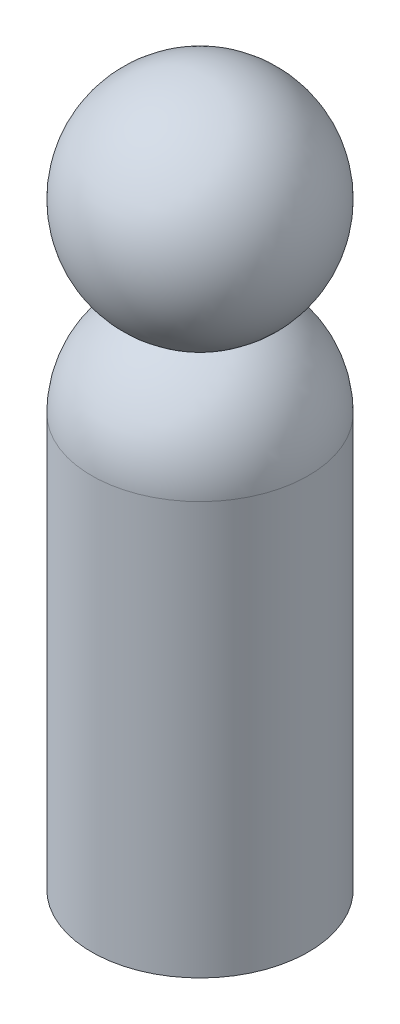
ISO-10303-21;
HEADER;
FILE_DESCRIPTION(('STEP AP214'),'2;1');
FILE_NAME('part.step','',(''),(''),'','','');
FILE_SCHEMA(('AUTOMOTIVE_DESIGN { 1 0 10303 214 1 1 1 1 }'));
ENDSEC;
DATA;
#1=APPLICATION_CONTEXT('core data for automotive mechanical design processes');
#2=APPLICATION_PROTOCOL_DEFINITION('international standard','automotive_design',2000,#1);
#3=PRODUCT_CONTEXT('',#1,'mechanical');
#4=PRODUCT('Part','Part','',(#3));
#5=PRODUCT_RELATED_PRODUCT_CATEGORY('part','',(#4));
#6=PRODUCT_DEFINITION_FORMATION('','',#4);
#7=PRODUCT_DEFINITION_CONTEXT('part definition',#1,'design');
#8=PRODUCT_DEFINITION('design','',#6,#7);
#9=PRODUCT_DEFINITION_SHAPE('','',#8);
#10=(LENGTH_UNIT() NAMED_UNIT(*) SI_UNIT(.MILLI.,.METRE.));
#11=(NAMED_UNIT(*) PLANE_ANGLE_UNIT() SI_UNIT($,.RADIAN.));
#12=(NAMED_UNIT(*) SI_UNIT($,.STERADIAN.) SOLID_ANGLE_UNIT());
#13=UNCERTAINTY_MEASURE_WITH_UNIT(LENGTH_MEASURE(1.E-05),#10,'distance_accuracy_value','');
#14=(GEOMETRIC_REPRESENTATION_CONTEXT(3) GLOBAL_UNCERTAINTY_ASSIGNED_CONTEXT((#13)) GLOBAL_UNIT_ASSIGNED_CONTEXT((#10,
#11,#12)) REPRESENTATION_CONTEXT('',''));
#15=CARTESIAN_POINT('',(0.,0.,0.));
#16=DIRECTION('',(0.,0.,1.));
#17=DIRECTION('',(1.,0.,0.));
#18=AXIS2_PLACEMENT_3D('',#15,#16,#17);
#19=CARTESIAN_POINT('',(0.,0.,0.));
#20=DIRECTION('',(0.,-1.,0.));
#21=DIRECTION('',(0.,0.,-1.));
#22=AXIS2_PLACEMENT_3D('',#19,#20,#21);
#23=CYLINDRICAL_SURFACE('',#22,21.43125);
#24=CARTESIAN_POINT('',(0.,81.6026206743408,0.));
#25=DIRECTION('',(0.,-1.,0.));
#26=DIRECTION('',(0.,0.,-1.));
#27=AXIS2_PLACEMENT_3D('',#24,#25,#26);
#28=CIRCLE('',#27,21.43125);
#29=CARTESIAN_POINT('',(0.,81.6026206743408,-21.43125));
#30=VERTEX_POINT('',#29);
#31=EDGE_CURVE('E11',#30,#30,#28,.T.);
#32=ORIENTED_EDGE('',*,*,#31,.T.);
#33=EDGE_LOOP('',(#32));
#34=FACE_BOUND('',#33,.T.);
#35=CARTESIAN_POINT('',(0.,0.,0.));
#36=DIRECTION('',(0.,-1.,0.));
#37=DIRECTION('',(0.,0.,-1.));
#38=AXIS2_PLACEMENT_3D('',#35,#36,#37);
#39=CIRCLE('',#38,21.43125);
#40=CARTESIAN_POINT('',(0.,0.,-21.43125));
#41=VERTEX_POINT('',#40);
#42=EDGE_CURVE('E46',#41,#41,#39,.T.);
#43=ORIENTED_EDGE('',*,*,#42,.F.);
#44=EDGE_LOOP('',(#43));
#45=FACE_BOUND('',#44,.T.);
#46=ADVANCED_FACE('F36',(#34,#45),#23,.T.);
#47=CARTESIAN_POINT('',(0.,81.602620674341,0.));
#48=DIRECTION('',(0.,-1.,0.));
#49=DIRECTION('',(0.,0.,-1.));
#50=AXIS2_PLACEMENT_3D('',#47,#48,#49);
#51=DEGENERATE_TOROIDAL_SURFACE('',#50,1.11125,20.32,.T.);
#52=CARTESIAN_POINT('',(0.,99.6054399168058,0.));
#53=DIRECTION('',(0.,-1.,0.));
#54=DIRECTION('',(0.,0.,-1.));
#55=AXIS2_PLACEMENT_3D('',#52,#53,#54);
#56=CIRCLE('',#55,10.5346729090675);
#57=CARTESIAN_POINT('',(0.,99.6054399168058,-10.5346729090675));
#58=VERTEX_POINT('',#57);
#59=EDGE_CURVE('E42',#58,#58,#56,.T.);
#60=ORIENTED_EDGE('',*,*,#59,.T.);
#61=EDGE_LOOP('',(#60));
#62=FACE_BOUND('',#61,.T.);
#63=ORIENTED_EDGE('',*,*,#31,.F.);
#64=EDGE_LOOP('',(#63));
#65=FACE_BOUND('',#64,.T.);
#66=ADVANCED_FACE('F56',(#62,#65),#51,.T.);
#67=CARTESIAN_POINT('',(0.,118.26875,0.));
#68=DIRECTION('',(0.,-1.,0.));
#69=DIRECTION('',(1.,0.,0.));
#70=AXIS2_PLACEMENT_3D('',#67,#68,#69);
#71=SPHERICAL_SURFACE('',#70,21.43125);
#72=ORIENTED_EDGE('',*,*,#59,.F.);
#73=EDGE_LOOP('',(#72));
#74=FACE_BOUND('',#73,.T.);
#75=ADVANCED_FACE('F60',(#74),#71,.T.);
#76=CARTESIAN_POINT('',(0.,0.,0.));
#77=DIRECTION('',(0.,-1.,0.));
#78=DIRECTION('',(0.,0.,-1.));
#79=AXIS2_PLACEMENT_3D('',#76,#77,#78);
#80=PLANE('',#79);
#81=ORIENTED_EDGE('',*,*,#42,.T.);
#82=EDGE_LOOP('',(#81));
#83=FACE_BOUND('',#82,.T.);
#84=ADVANCED_FACE('F53',(#83),#80,.T.);
#85=CLOSED_SHELL('',(#46,#66,#75,#84));
#86=MANIFOLD_SOLID_BREP('B2',#85);
#87=ADVANCED_BREP_SHAPE_REPRESENTATION('',(#18,#86),#14);
#88=SHAPE_DEFINITION_REPRESENTATION(#9,#87);
ENDSEC;
END-ISO-10303-21;
